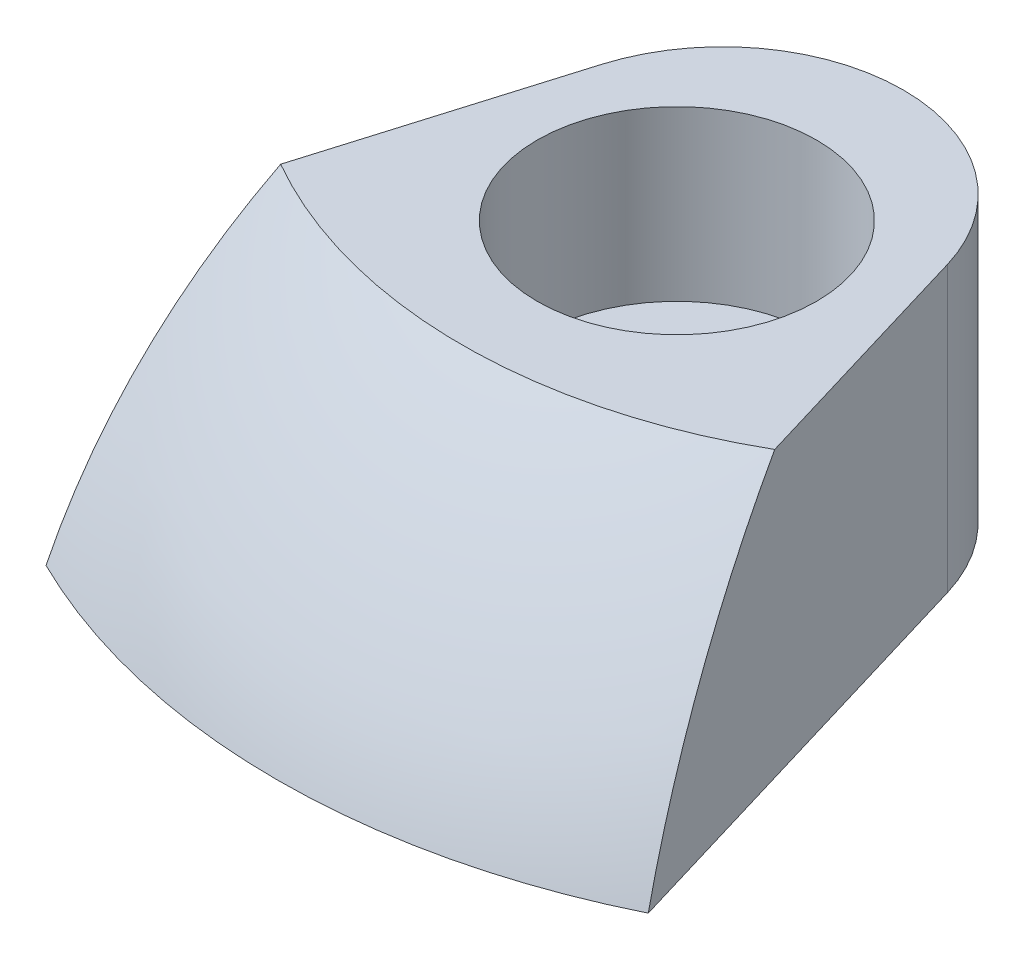
ISO-10303-21;
HEADER;
FILE_DESCRIPTION(('STEP AP214'),'2;1');
FILE_NAME('part.step','',(''),(''),'','','');
FILE_SCHEMA(('AUTOMOTIVE_DESIGN { 1 0 10303 214 1 1 1 1 }'));
ENDSEC;
DATA;
#1=APPLICATION_CONTEXT('core data for automotive mechanical design processes');
#2=APPLICATION_PROTOCOL_DEFINITION('international standard','automotive_design',2000,#1);
#3=PRODUCT_CONTEXT('',#1,'mechanical');
#4=PRODUCT('Part','Part','',(#3));
#5=PRODUCT_RELATED_PRODUCT_CATEGORY('part','',(#4));
#6=PRODUCT_DEFINITION_FORMATION('','',#4);
#7=PRODUCT_DEFINITION_CONTEXT('part definition',#1,'design');
#8=PRODUCT_DEFINITION('design','',#6,#7);
#9=PRODUCT_DEFINITION_SHAPE('','',#8);
#10=(LENGTH_UNIT() NAMED_UNIT(*) SI_UNIT(.MILLI.,.METRE.));
#11=(NAMED_UNIT(*) PLANE_ANGLE_UNIT() SI_UNIT($,.RADIAN.));
#12=(NAMED_UNIT(*) SI_UNIT($,.STERADIAN.) SOLID_ANGLE_UNIT());
#13=UNCERTAINTY_MEASURE_WITH_UNIT(LENGTH_MEASURE(1.E-05),#10,'distance_accuracy_value','');
#14=(GEOMETRIC_REPRESENTATION_CONTEXT(3) GLOBAL_UNCERTAINTY_ASSIGNED_CONTEXT((#13)) GLOBAL_UNIT_ASSIGNED_CONTEXT((#10,
#11,#12)) REPRESENTATION_CONTEXT('',''));
#15=CARTESIAN_POINT('',(0.,0.,0.));
#16=DIRECTION('',(0.,0.,1.));
#17=DIRECTION('',(1.,0.,0.));
#18=AXIS2_PLACEMENT_3D('',#15,#16,#17);
#19=CARTESIAN_POINT('',(0.,6.35,0.));
#20=DIRECTION('',(0.,1.,0.));
#21=DIRECTION('',(0.,0.,1.));
#22=AXIS2_PLACEMENT_3D('',#19,#20,#21);
#23=PLANE('',#22);
#24=CARTESIAN_POINT('',(0.,6.35,7.41951224213831));
#25=DIRECTION('',(0.,-1.,0.));
#26=DIRECTION('',(0.,0.,-1.));
#27=AXIS2_PLACEMENT_3D('',#24,#25,#26);
#28=CIRCLE('',#27,2.2225);
#29=CARTESIAN_POINT('',(0.,6.35,5.19701224213831));
#30=VERTEX_POINT('',#29);
#31=EDGE_CURVE('E105',#30,#30,#28,.T.);
#32=ORIENTED_EDGE('',*,*,#31,.F.);
#33=EDGE_LOOP('',(#32));
#34=FACE_BOUND('',#33,.T.);
#35=DIRECTION('',(0.287020091162854,0.,0.957924562410249));
#36=VECTOR('',#35,1.);
#37=CARTESIAN_POINT('',(4.56211572847881,6.35,4.84607905797522));
#38=LINE('',#37,#36);
#39=CARTESIAN_POINT('',(4.56211572847881,6.35,4.84607905797522));
#40=VERTEX_POINT('',#39);
#41=CARTESIAN_POINT('',(7.9375,6.35,16.1113653595839));
#42=VERTEX_POINT('',#41);
#43=EDGE_CURVE('E84',#40,#42,#38,.T.);
#44=ORIENTED_EDGE('',*,*,#43,.T.);
#45=CARTESIAN_POINT('',(0.,6.35,0.));
#46=DIRECTION('',(0.,1.,0.));
#47=DIRECTION('',(0.,0.,1.));
#48=AXIS2_PLACEMENT_3D('',#45,#46,#47);
#49=CIRCLE('',#48,17.9605122421383);
#50=CARTESIAN_POINT('',(-7.9375,6.35,16.1113653595839));
#51=VERTEX_POINT('',#50);
#52=EDGE_CURVE('E118',#51,#42,#49,.T.);
#53=ORIENTED_EDGE('',*,*,#52,.F.);
#54=DIRECTION('',(0.287020091162854,0.,-0.957924562410249));
#55=VECTOR('',#54,1.);
#56=CARTESIAN_POINT('',(-4.56211572847881,6.35,4.84607905797522));
#57=LINE('',#56,#55);
#58=CARTESIAN_POINT('',(-4.56211572847881,6.35,4.84607905797522));
#59=VERTEX_POINT('',#58);
#60=EDGE_CURVE('E93',#51,#59,#57,.T.);
#61=ORIENTED_EDGE('',*,*,#60,.T.);
#62=CARTESIAN_POINT('',(0.,6.35,6.21301224213831));
#63=DIRECTION('',(0.,-1.,0.));
#64=DIRECTION('',(0.,0.,1.));
#65=AXIS2_PLACEMENT_3D('',#62,#63,#64);
#66=CIRCLE('',#65,4.7625);
#67=EDGE_CURVE('E94',#59,#40,#66,.T.);
#68=ORIENTED_EDGE('',*,*,#67,.T.);
#69=EDGE_LOOP('',(#44,#53,#61,#68));
#70=FACE_BOUND('',#69,.T.);
#71=ADVANCED_FACE('F45',(#34,#70),#23,.F.);
#72=CARTESIAN_POINT('',(0.,0.,0.));
#73=DIRECTION('',(0.,1.,0.));
#74=DIRECTION('',(1.,0.,0.));
#75=AXIS2_PLACEMENT_3D('',#72,#73,#74);
#76=SPHERICAL_SURFACE('',#75,19.05);
#77=CARTESIAN_POINT('',(2.85388780541652,0.,-0.855101925790687));
#78=DIRECTION('',(0.957924562410249,0.,-0.287020091162854));
#79=DIRECTION('',(-0.287020091162854,0.,-0.957924562410249));
#80=AXIS2_PLACEMENT_3D('',#77,#78,#79);
#81=CIRCLE('',#80,18.815595262723);
#82=CARTESIAN_POINT('',(6.51154166886529,13.843,11.3522542296511));
#83=VERTEX_POINT('',#82);
#84=EDGE_CURVE('E88',#83,#42,#81,.T.);
#85=ORIENTED_EDGE('',*,*,#84,.F.);
#86=CARTESIAN_POINT('',(0.,13.843,0.));
#87=DIRECTION('',(0.,1.,0.));
#88=DIRECTION('',(0.,0.,1.));
#89=AXIS2_PLACEMENT_3D('',#86,#87,#88);
#90=CIRCLE('',#89,13.0871635964406);
#91=CARTESIAN_POINT('',(-6.51154166886529,13.843,11.3522542296511));
#92=VERTEX_POINT('',#91);
#93=EDGE_CURVE('E53',#92,#83,#90,.T.);
#94=ORIENTED_EDGE('',*,*,#93,.F.);
#95=CARTESIAN_POINT('',(-2.85388780541652,0.,-0.855101925790687));
#96=DIRECTION('',(-0.957924562410249,0.,-0.287020091162854));
#97=DIRECTION('',(-0.287020091162854,0.,0.957924562410249));
#98=AXIS2_PLACEMENT_3D('',#95,#96,#97);
#99=CIRCLE('',#98,18.815595262723);
#100=EDGE_CURVE('E60',#51,#92,#99,.T.);
#101=ORIENTED_EDGE('',*,*,#100,.F.);
#102=ORIENTED_EDGE('',*,*,#52,.T.);
#103=EDGE_LOOP('',(#85,#94,#101,#102));
#104=FACE_BOUND('',#103,.T.);
#105=ADVANCED_FACE('F47',(#104),#76,.T.);
#106=CARTESIAN_POINT('',(0.,13.843,0.));
#107=DIRECTION('',(0.,1.,0.));
#108=DIRECTION('',(0.,0.,1.));
#109=AXIS2_PLACEMENT_3D('',#106,#107,#108);
#110=PLANE('',#109);
#111=CARTESIAN_POINT('',(0.,13.843,7.41951224213831));
#112=DIRECTION('',(0.,-1.,0.));
#113=DIRECTION('',(0.,0.,-1.));
#114=AXIS2_PLACEMENT_3D('',#111,#112,#113);
#115=CIRCLE('',#114,3.683);
#116=CARTESIAN_POINT('',(0.,13.843,3.73651224213831));
#117=VERTEX_POINT('',#116);
#118=EDGE_CURVE('E148',#117,#117,#115,.T.);
#119=ORIENTED_EDGE('',*,*,#118,.T.);
#120=EDGE_LOOP('',(#119));
#121=FACE_BOUND('',#120,.T.);
#122=ORIENTED_EDGE('',*,*,#93,.T.);
#123=DIRECTION('',(0.287020091162854,0.,0.957924562410249));
#124=VECTOR('',#123,1.);
#125=CARTESIAN_POINT('',(4.56211572847881,13.843,4.84607905797522));
#126=LINE('',#125,#124);
#127=CARTESIAN_POINT('',(4.56211572847881,13.843,4.84607905797522));
#128=VERTEX_POINT('',#127);
#129=EDGE_CURVE('E67',#128,#83,#126,.T.);
#130=ORIENTED_EDGE('',*,*,#129,.F.);
#131=CARTESIAN_POINT('',(0.,13.843,6.21301224213831));
#132=DIRECTION('',(0.,-1.,0.));
#133=DIRECTION('',(0.,0.,1.));
#134=AXIS2_PLACEMENT_3D('',#131,#132,#133);
#135=CIRCLE('',#134,4.7625);
#136=CARTESIAN_POINT('',(-4.56211572847881,13.843,4.84607905797522));
#137=VERTEX_POINT('',#136);
#138=EDGE_CURVE('E102',#137,#128,#135,.T.);
#139=ORIENTED_EDGE('',*,*,#138,.F.);
#140=DIRECTION('',(-0.287020091162854,0.,0.957924562410249));
#141=VECTOR('',#140,1.);
#142=CARTESIAN_POINT('',(-2.85388780541651,13.843,-0.855101925790687));
#143=LINE('',#142,#141);
#144=EDGE_CURVE('E14',#137,#92,#143,.T.);
#145=ORIENTED_EDGE('',*,*,#144,.T.);
#146=EDGE_LOOP('',(#122,#130,#139,#145));
#147=FACE_BOUND('',#146,.T.);
#148=ADVANCED_FACE('F123',(#121,#147),#110,.T.);
#149=CARTESIAN_POINT('',(4.56211572847881,13.843,4.84607905797522));
#150=DIRECTION('',(0.957924562410249,0.,-0.287020091162854));
#151=DIRECTION('',(-0.287020091162854,0.,-0.957924562410249));
#152=AXIS2_PLACEMENT_3D('',#149,#150,#151);
#153=PLANE('',#152);
#154=ORIENTED_EDGE('',*,*,#84,.T.);
#155=ORIENTED_EDGE('',*,*,#43,.F.);
#156=DIRECTION('',(0.,-1.,0.));
#157=VECTOR('',#156,1.);
#158=CARTESIAN_POINT('',(4.56211572847881,13.843,4.84607905797522));
#159=LINE('',#158,#157);
#160=EDGE_CURVE('E87',#128,#40,#159,.T.);
#161=ORIENTED_EDGE('',*,*,#160,.F.);
#162=ORIENTED_EDGE('',*,*,#129,.T.);
#163=EDGE_LOOP('',(#154,#155,#161,#162));
#164=FACE_BOUND('',#163,.T.);
#165=ADVANCED_FACE('F86',(#164),#153,.T.);
#166=CARTESIAN_POINT('',(-4.56211572847881,13.843,4.84607905797522));
#167=DIRECTION('',(-0.957924562410249,0.,-0.287020091162854));
#168=DIRECTION('',(-0.287020091162854,0.,0.957924562410249));
#169=AXIS2_PLACEMENT_3D('',#166,#167,#168);
#170=PLANE('',#169);
#171=ORIENTED_EDGE('',*,*,#100,.T.);
#172=ORIENTED_EDGE('',*,*,#144,.F.);
#173=DIRECTION('',(0.,-1.,0.));
#174=VECTOR('',#173,1.);
#175=CARTESIAN_POINT('',(-4.56211572847881,13.843,4.84607905797522));
#176=LINE('',#175,#174);
#177=EDGE_CURVE('E103',#137,#59,#176,.T.);
#178=ORIENTED_EDGE('',*,*,#177,.T.);
#179=ORIENTED_EDGE('',*,*,#60,.F.);
#180=EDGE_LOOP('',(#171,#172,#178,#179));
#181=FACE_BOUND('',#180,.T.);
#182=ADVANCED_FACE('F124',(#181),#170,.T.);
#183=CARTESIAN_POINT('',(0.,13.843,6.21301224213831));
#184=DIRECTION('',(0.,-1.,0.));
#185=DIRECTION('',(0.,0.,-1.));
#186=AXIS2_PLACEMENT_3D('',#183,#184,#185);
#187=CYLINDRICAL_SURFACE('',#186,4.7625);
#188=ORIENTED_EDGE('',*,*,#67,.F.);
#189=ORIENTED_EDGE('',*,*,#177,.F.);
#190=ORIENTED_EDGE('',*,*,#138,.T.);
#191=ORIENTED_EDGE('',*,*,#160,.T.);
#192=EDGE_LOOP('',(#188,#189,#190,#191));
#193=FACE_BOUND('',#192,.T.);
#194=ADVANCED_FACE('F98',(#193),#187,.T.);
#195=CARTESIAN_POINT('',(0.,6.35,7.41951224213831));
#196=DIRECTION('',(0.,-1.,0.));
#197=DIRECTION('',(0.,0.,-1.));
#198=AXIS2_PLACEMENT_3D('',#195,#196,#197);
#199=CYLINDRICAL_SURFACE('',#198,2.2225);
#200=CARTESIAN_POINT('',(0.,9.398,7.41951224213831));
#201=DIRECTION('',(0.,-1.,0.));
#202=DIRECTION('',(0.,0.,-1.));
#203=AXIS2_PLACEMENT_3D('',#200,#201,#202);
#204=CIRCLE('',#203,2.2225);
#205=CARTESIAN_POINT('',(0.,9.398,5.19701224213831));
#206=VERTEX_POINT('',#205);
#207=EDGE_CURVE('E108',#206,#206,#204,.T.);
#208=ORIENTED_EDGE('',*,*,#207,.F.);
#209=EDGE_LOOP('',(#208));
#210=FACE_BOUND('',#209,.T.);
#211=ORIENTED_EDGE('',*,*,#31,.T.);
#212=EDGE_LOOP('',(#211));
#213=FACE_BOUND('',#212,.T.);
#214=ADVANCED_FACE('F131',(#210,#213),#199,.F.);
#215=CARTESIAN_POINT('',(0.,9.398,5.19701224213831));
#216=DIRECTION('',(0.,-1.,0.));
#217=DIRECTION('',(0.,0.,-1.));
#218=AXIS2_PLACEMENT_3D('',#215,#216,#217);
#219=PLANE('',#218);
#220=CARTESIAN_POINT('',(0.,9.398,7.41951224213831));
#221=DIRECTION('',(0.,-1.,0.));
#222=DIRECTION('',(0.,0.,-1.));
#223=AXIS2_PLACEMENT_3D('',#220,#221,#222);
#224=CIRCLE('',#223,3.683);
#225=CARTESIAN_POINT('',(0.,9.398,3.73651224213831));
#226=VERTEX_POINT('',#225);
#227=EDGE_CURVE('E150',#226,#226,#224,.T.);
#228=ORIENTED_EDGE('',*,*,#227,.F.);
#229=EDGE_LOOP('',(#228));
#230=FACE_BOUND('',#229,.T.);
#231=ORIENTED_EDGE('',*,*,#207,.T.);
#232=EDGE_LOOP('',(#231));
#233=FACE_BOUND('',#232,.T.);
#234=ADVANCED_FACE('F157',(#230,#233),#219,.F.);
#235=CARTESIAN_POINT('',(0.,6.35,7.41951224213831));
#236=DIRECTION('',(0.,-1.,0.));
#237=DIRECTION('',(0.,0.,-1.));
#238=AXIS2_PLACEMENT_3D('',#235,#236,#237);
#239=CYLINDRICAL_SURFACE('',#238,3.683);
#240=ORIENTED_EDGE('',*,*,#118,.F.);
#241=EDGE_LOOP('',(#240));
#242=FACE_BOUND('',#241,.T.);
#243=ORIENTED_EDGE('',*,*,#227,.T.);
#244=EDGE_LOOP('',(#243));
#245=FACE_BOUND('',#244,.T.);
#246=ADVANCED_FACE('F164',(#242,#245),#239,.F.);
#247=CLOSED_SHELL('',(#71,#105,#148,#165,#182,#194,#214,#234,#246));
#248=MANIFOLD_SOLID_BREP('B2',#247);
#249=ADVANCED_BREP_SHAPE_REPRESENTATION('',(#18,#248),#14);
#250=SHAPE_DEFINITION_REPRESENTATION(#9,#249);
ENDSEC;
END-ISO-10303-21;
